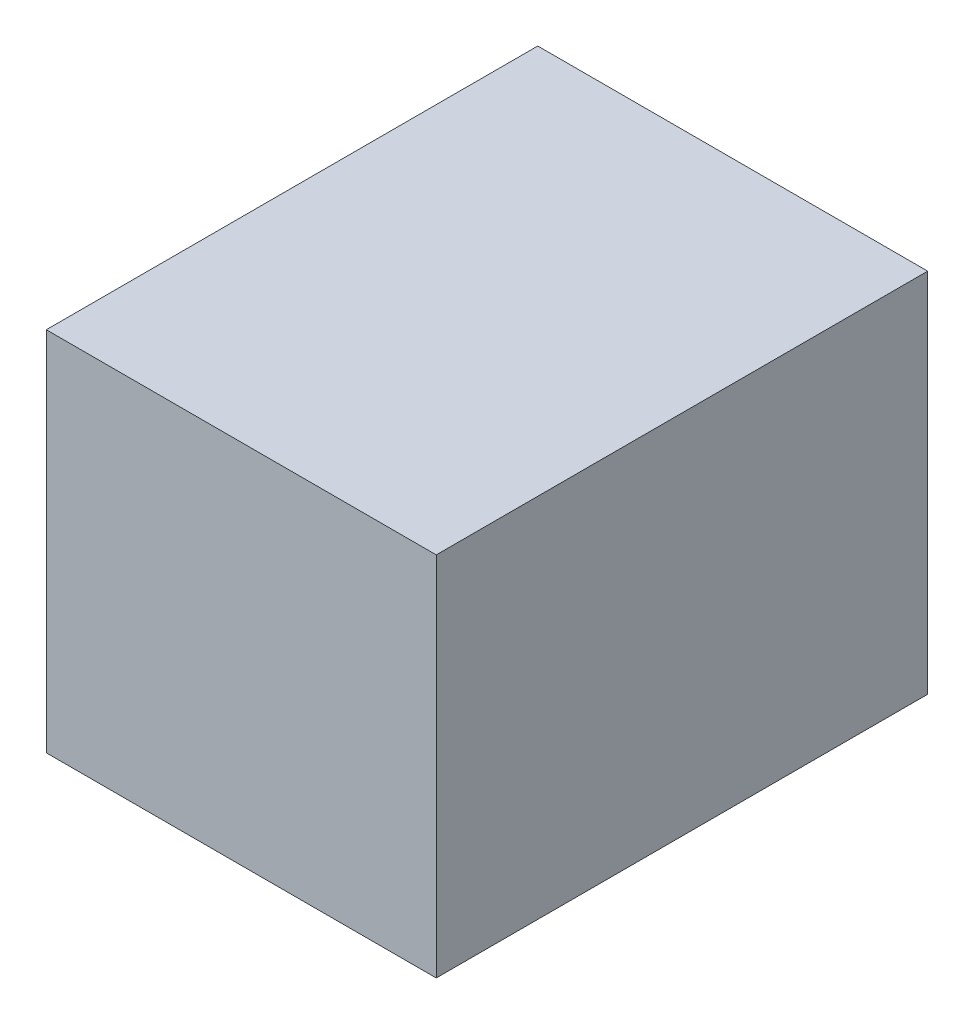
ISO-10303-21;
HEADER;
FILE_DESCRIPTION(('STEP AP214'),'2;1');
FILE_NAME('part.step','',(''),(''),'','','');
FILE_SCHEMA(('AUTOMOTIVE_DESIGN { 1 0 10303 214 1 1 1 1 }'));
ENDSEC;
DATA;
#1=APPLICATION_CONTEXT('core data for automotive mechanical design processes');
#2=APPLICATION_PROTOCOL_DEFINITION('international standard','automotive_design',2000,#1);
#3=PRODUCT_CONTEXT('',#1,'mechanical');
#4=PRODUCT('Part','Part','',(#3));
#5=PRODUCT_RELATED_PRODUCT_CATEGORY('part','',(#4));
#6=PRODUCT_DEFINITION_FORMATION('','',#4);
#7=PRODUCT_DEFINITION_CONTEXT('part definition',#1,'design');
#8=PRODUCT_DEFINITION('design','',#6,#7);
#9=PRODUCT_DEFINITION_SHAPE('','',#8);
#10=(LENGTH_UNIT() NAMED_UNIT(*) SI_UNIT(.MILLI.,.METRE.));
#11=(NAMED_UNIT(*) PLANE_ANGLE_UNIT() SI_UNIT($,.RADIAN.));
#12=(NAMED_UNIT(*) SI_UNIT($,.STERADIAN.) SOLID_ANGLE_UNIT());
#13=UNCERTAINTY_MEASURE_WITH_UNIT(LENGTH_MEASURE(1.E-05),#10,'distance_accuracy_value','');
#14=(GEOMETRIC_REPRESENTATION_CONTEXT(3) GLOBAL_UNCERTAINTY_ASSIGNED_CONTEXT((#13)) GLOBAL_UNIT_ASSIGNED_CONTEXT((#10,
#11,#12)) REPRESENTATION_CONTEXT('',''));
#15=CARTESIAN_POINT('',(0.,0.,0.));
#16=DIRECTION('',(0.,0.,1.));
#17=DIRECTION('',(1.,0.,0.));
#18=AXIS2_PLACEMENT_3D('',#15,#16,#17);
#19=CARTESIAN_POINT('',(18.25,34.3,23.));
#20=DIRECTION('',(-1.,0.,0.));
#21=DIRECTION('',(0.,0.,1.));
#22=AXIS2_PLACEMENT_3D('',#19,#20,#21);
#23=PLANE('',#22);
#24=DIRECTION('',(0.,0.,-1.));
#25=VECTOR('',#24,1.);
#26=CARTESIAN_POINT('',(18.25,0.,23.));
#27=LINE('',#26,#25);
#28=CARTESIAN_POINT('',(18.25,0.,23.));
#29=VERTEX_POINT('',#28);
#30=CARTESIAN_POINT('',(18.25,0.,-23.));
#31=VERTEX_POINT('',#30);
#32=EDGE_CURVE('E115',#29,#31,#27,.T.);
#33=ORIENTED_EDGE('',*,*,#32,.T.);
#34=DIRECTION('',(0.,-1.,0.));
#35=VECTOR('',#34,1.);
#36=CARTESIAN_POINT('',(18.25,34.3,-23.));
#37=LINE('',#36,#35);
#38=CARTESIAN_POINT('',(18.25,34.3,-23.));
#39=VERTEX_POINT('',#38);
#40=EDGE_CURVE('E11',#39,#31,#37,.T.);
#41=ORIENTED_EDGE('',*,*,#40,.F.);
#42=DIRECTION('',(0.,0.,-1.));
#43=VECTOR('',#42,1.);
#44=CARTESIAN_POINT('',(18.25,34.3,23.));
#45=LINE('',#44,#43);
#46=CARTESIAN_POINT('',(18.25,34.3,23.));
#47=VERTEX_POINT('',#46);
#48=EDGE_CURVE('E99',#47,#39,#45,.T.);
#49=ORIENTED_EDGE('',*,*,#48,.F.);
#50=DIRECTION('',(0.,-1.,0.));
#51=VECTOR('',#50,1.);
#52=CARTESIAN_POINT('',(18.25,34.3,23.));
#53=LINE('',#52,#51);
#54=EDGE_CURVE('E111',#47,#29,#53,.T.);
#55=ORIENTED_EDGE('',*,*,#54,.T.);
#56=EDGE_LOOP('',(#33,#41,#49,#55));
#57=FACE_BOUND('',#56,.T.);
#58=ADVANCED_FACE('F47',(#57),#23,.F.);
#59=CARTESIAN_POINT('',(-18.25,34.3,-23.));
#60=DIRECTION('',(0.,0.,1.));
#61=DIRECTION('',(1.,0.,0.));
#62=AXIS2_PLACEMENT_3D('',#59,#60,#61);
#63=PLANE('',#62);
#64=DIRECTION('',(-1.,0.,0.));
#65=VECTOR('',#64,1.);
#66=CARTESIAN_POINT('',(-18.25,0.,-23.));
#67=LINE('',#66,#65);
#68=CARTESIAN_POINT('',(-18.25,0.,-23.));
#69=VERTEX_POINT('',#68);
#70=EDGE_CURVE('E104',#31,#69,#67,.T.);
#71=ORIENTED_EDGE('',*,*,#70,.T.);
#72=DIRECTION('',(0.,-1.,0.));
#73=VECTOR('',#72,1.);
#74=CARTESIAN_POINT('',(-18.25,34.3,-23.));
#75=LINE('',#74,#73);
#76=CARTESIAN_POINT('',(-18.25,34.3,-23.));
#77=VERTEX_POINT('',#76);
#78=EDGE_CURVE('E56',#77,#69,#75,.T.);
#79=ORIENTED_EDGE('',*,*,#78,.F.);
#80=DIRECTION('',(-1.,0.,0.));
#81=VECTOR('',#80,1.);
#82=CARTESIAN_POINT('',(-18.25,34.3,-23.));
#83=LINE('',#82,#81);
#84=EDGE_CURVE('E94',#39,#77,#83,.T.);
#85=ORIENTED_EDGE('',*,*,#84,.F.);
#86=ORIENTED_EDGE('',*,*,#40,.T.);
#87=EDGE_LOOP('',(#71,#79,#85,#86));
#88=FACE_BOUND('',#87,.T.);
#89=ADVANCED_FACE('F103',(#88),#63,.F.);
#90=CARTESIAN_POINT('',(-18.25,34.3,23.));
#91=DIRECTION('',(1.,0.,0.));
#92=DIRECTION('',(0.,0.,-1.));
#93=AXIS2_PLACEMENT_3D('',#90,#91,#92);
#94=PLANE('',#93);
#95=DIRECTION('',(0.,0.,1.));
#96=VECTOR('',#95,1.);
#97=CARTESIAN_POINT('',(-18.25,0.,23.));
#98=LINE('',#97,#96);
#99=CARTESIAN_POINT('',(-18.25,0.,23.));
#100=VERTEX_POINT('',#99);
#101=EDGE_CURVE('E81',#69,#100,#98,.T.);
#102=ORIENTED_EDGE('',*,*,#101,.T.);
#103=DIRECTION('',(0.,-1.,0.));
#104=VECTOR('',#103,1.);
#105=CARTESIAN_POINT('',(-18.25,34.3,23.));
#106=LINE('',#105,#104);
#107=CARTESIAN_POINT('',(-18.25,34.3,23.));
#108=VERTEX_POINT('',#107);
#109=EDGE_CURVE('E106',#108,#100,#106,.T.);
#110=ORIENTED_EDGE('',*,*,#109,.F.);
#111=DIRECTION('',(0.,0.,1.));
#112=VECTOR('',#111,1.);
#113=CARTESIAN_POINT('',(-18.25,34.3,23.));
#114=LINE('',#113,#112);
#115=EDGE_CURVE('E97',#77,#108,#114,.T.);
#116=ORIENTED_EDGE('',*,*,#115,.F.);
#117=ORIENTED_EDGE('',*,*,#78,.T.);
#118=EDGE_LOOP('',(#102,#110,#116,#117));
#119=FACE_BOUND('',#118,.T.);
#120=ADVANCED_FACE('F107',(#119),#94,.F.);
#121=CARTESIAN_POINT('',(-18.25,34.3,23.));
#122=DIRECTION('',(0.,0.,-1.));
#123=DIRECTION('',(-1.,0.,0.));
#124=AXIS2_PLACEMENT_3D('',#121,#122,#123);
#125=PLANE('',#124);
#126=DIRECTION('',(1.,0.,0.));
#127=VECTOR('',#126,1.);
#128=CARTESIAN_POINT('',(-18.25,0.,23.));
#129=LINE('',#128,#127);
#130=EDGE_CURVE('E87',#100,#29,#129,.T.);
#131=ORIENTED_EDGE('',*,*,#130,.T.);
#132=ORIENTED_EDGE('',*,*,#54,.F.);
#133=DIRECTION('',(1.,0.,0.));
#134=VECTOR('',#133,1.);
#135=CARTESIAN_POINT('',(-18.25,34.3,23.));
#136=LINE('',#135,#134);
#137=EDGE_CURVE('E64',#108,#47,#136,.T.);
#138=ORIENTED_EDGE('',*,*,#137,.F.);
#139=ORIENTED_EDGE('',*,*,#109,.T.);
#140=EDGE_LOOP('',(#131,#132,#138,#139));
#141=FACE_BOUND('',#140,.T.);
#142=ADVANCED_FACE('F128',(#141),#125,.F.);
#143=CARTESIAN_POINT('',(0.,34.3,0.));
#144=DIRECTION('',(0.,-1.,0.));
#145=DIRECTION('',(0.,0.,-1.));
#146=AXIS2_PLACEMENT_3D('',#143,#144,#145);
#147=PLANE('',#146);
#148=ORIENTED_EDGE('',*,*,#48,.T.);
#149=ORIENTED_EDGE('',*,*,#84,.T.);
#150=ORIENTED_EDGE('',*,*,#115,.T.);
#151=ORIENTED_EDGE('',*,*,#137,.T.);
#152=EDGE_LOOP('',(#148,#149,#150,#151));
#153=FACE_BOUND('',#152,.T.);
#154=ADVANCED_FACE('F95',(#153),#147,.F.);
#155=CARTESIAN_POINT('',(0.,0.,0.));
#156=DIRECTION('',(0.,-1.,0.));
#157=DIRECTION('',(0.,0.,-1.));
#158=AXIS2_PLACEMENT_3D('',#155,#156,#157);
#159=PLANE('',#158);
#160=ORIENTED_EDGE('',*,*,#32,.F.);
#161=ORIENTED_EDGE('',*,*,#130,.F.);
#162=ORIENTED_EDGE('',*,*,#101,.F.);
#163=ORIENTED_EDGE('',*,*,#70,.F.);
#164=EDGE_LOOP('',(#160,#161,#162,#163));
#165=FACE_BOUND('',#164,.T.);
#166=ADVANCED_FACE('F131',(#165),#159,.T.);
#167=CLOSED_SHELL('',(#58,#89,#120,#142,#154,#166));
#168=MANIFOLD_SOLID_BREP('B2',#167);
#169=ADVANCED_BREP_SHAPE_REPRESENTATION('',(#18,#168),#14);
#170=SHAPE_DEFINITION_REPRESENTATION(#9,#169);
ENDSEC;
END-ISO-10303-21;
